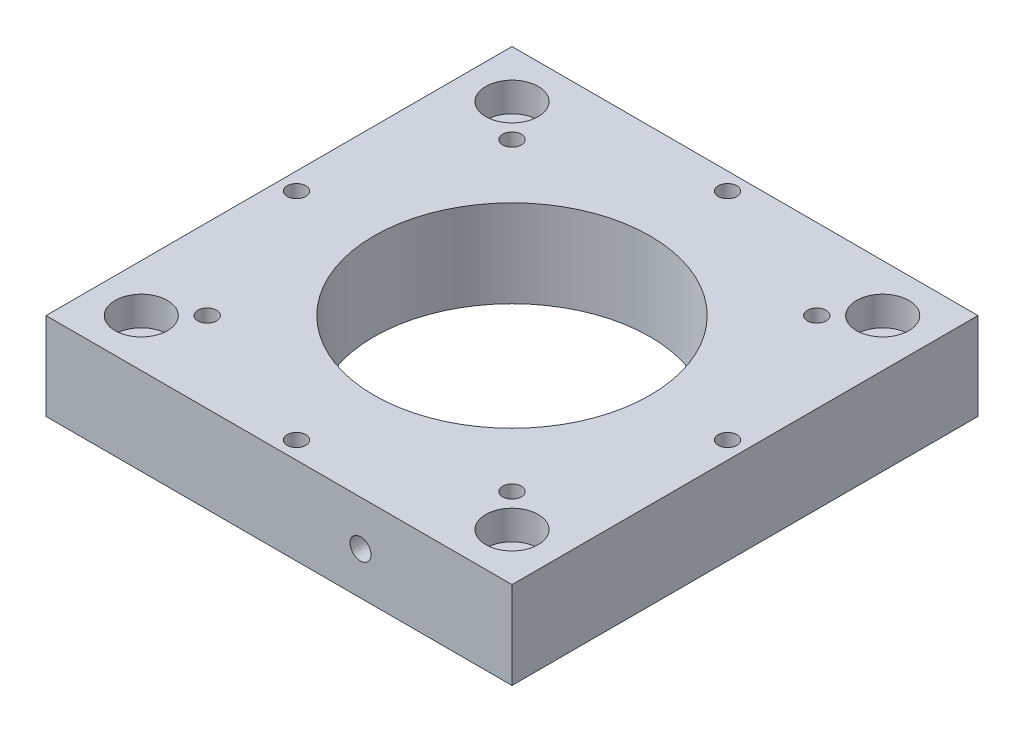
ISO-10303-21;
HEADER;
FILE_DESCRIPTION(('STEP AP214'),'2;1');
FILE_NAME('part.step','',(''),(''),'','','');
FILE_SCHEMA(('AUTOMOTIVE_DESIGN { 1 0 10303 214 1 1 1 1 }'));
ENDSEC;
DATA;
#1=APPLICATION_CONTEXT('core data for automotive mechanical design processes');
#2=APPLICATION_PROTOCOL_DEFINITION('international standard','automotive_design',2000,#1);
#3=PRODUCT_CONTEXT('',#1,'mechanical');
#4=PRODUCT('Part','Part','',(#3));
#5=PRODUCT_RELATED_PRODUCT_CATEGORY('part','',(#4));
#6=PRODUCT_DEFINITION_FORMATION('','',#4);
#7=PRODUCT_DEFINITION_CONTEXT('part definition',#1,'design');
#8=PRODUCT_DEFINITION('design','',#6,#7);
#9=PRODUCT_DEFINITION_SHAPE('','',#8);
#10=(LENGTH_UNIT() NAMED_UNIT(*) SI_UNIT(.MILLI.,.METRE.));
#11=(NAMED_UNIT(*) PLANE_ANGLE_UNIT() SI_UNIT($,.RADIAN.));
#12=(NAMED_UNIT(*) SI_UNIT($,.STERADIAN.) SOLID_ANGLE_UNIT());
#13=UNCERTAINTY_MEASURE_WITH_UNIT(LENGTH_MEASURE(1.E-05),#10,'distance_accuracy_value','');
#14=(GEOMETRIC_REPRESENTATION_CONTEXT(3) GLOBAL_UNCERTAINTY_ASSIGNED_CONTEXT((#13)) GLOBAL_UNIT_ASSIGNED_CONTEXT((#10,
#11,#12)) REPRESENTATION_CONTEXT('',''));
#15=CARTESIAN_POINT('',(0.,0.,0.));
#16=DIRECTION('',(0.,0.,1.));
#17=DIRECTION('',(1.,0.,0.));
#18=AXIS2_PLACEMENT_3D('',#15,#16,#17);
#19=CARTESIAN_POINT('',(-31.8198051533946,15.,-31.8198051533946));
#20=DIRECTION('',(0.,-1.,0.));
#21=DIRECTION('',(0.,0.,-1.));
#22=AXIS2_PLACEMENT_3D('',#19,#20,#21);
#23=CYLINDRICAL_SURFACE('',#22,2.6);
#24=CARTESIAN_POINT('',(-31.8198051533946,0.,-31.8198051533946));
#25=DIRECTION('',(0.,1.,0.));
#26=DIRECTION('',(0.,0.,1.));
#27=AXIS2_PLACEMENT_3D('',#24,#25,#26);
#28=CIRCLE('',#27,2.6);
#29=CARTESIAN_POINT('',(-31.8198051533946,0.,-29.2198051533946));
#30=VERTEX_POINT('',#29);
#31=EDGE_CURVE('E172',#30,#30,#28,.T.);
#32=ORIENTED_EDGE('',*,*,#31,.F.);
#33=EDGE_LOOP('',(#32));
#34=FACE_BOUND('',#33,.T.);
#35=CARTESIAN_POINT('',(-31.8198051533946,10.,-31.8198051533946));
#36=DIRECTION('',(0.,1.,0.));
#37=DIRECTION('',(0.,0.,1.));
#38=AXIS2_PLACEMENT_3D('',#35,#36,#37);
#39=CIRCLE('',#38,2.6);
#40=CARTESIAN_POINT('',(-31.8198051533946,10.,-29.2198051533946));
#41=VERTEX_POINT('',#40);
#42=EDGE_CURVE('E41',#41,#41,#39,.T.);
#43=ORIENTED_EDGE('',*,*,#42,.T.);
#44=EDGE_LOOP('',(#43));
#45=FACE_BOUND('',#44,.T.);
#46=ADVANCED_FACE('F37',(#34,#45),#23,.F.);
#47=CARTESIAN_POINT('',(-31.8198051533892,15.,31.8198051533946));
#48=DIRECTION('',(0.,-1.,0.));
#49=DIRECTION('',(0.,0.,-1.));
#50=AXIS2_PLACEMENT_3D('',#47,#48,#49);
#51=CYLINDRICAL_SURFACE('',#50,2.60000000000144);
#52=CARTESIAN_POINT('',(-31.8198051533892,0.,31.8198051533946));
#53=DIRECTION('',(0.,1.,0.));
#54=DIRECTION('',(0.,0.,1.));
#55=AXIS2_PLACEMENT_3D('',#52,#53,#54);
#56=CIRCLE('',#55,2.60000000000144);
#57=CARTESIAN_POINT('',(-31.8198051533892,0.,34.4198051533961));
#58=VERTEX_POINT('',#57);
#59=EDGE_CURVE('E169',#58,#58,#56,.T.);
#60=ORIENTED_EDGE('',*,*,#59,.F.);
#61=EDGE_LOOP('',(#60));
#62=FACE_BOUND('',#61,.T.);
#63=CARTESIAN_POINT('',(-31.8198051533892,10.,31.8198051533946));
#64=DIRECTION('',(0.,1.,0.));
#65=DIRECTION('',(0.,0.,1.));
#66=AXIS2_PLACEMENT_3D('',#63,#64,#65);
#67=CIRCLE('',#66,2.60000000000144);
#68=CARTESIAN_POINT('',(-31.8198051533892,10.,34.4198051533961));
#69=VERTEX_POINT('',#68);
#70=EDGE_CURVE('E146',#69,#69,#67,.T.);
#71=ORIENTED_EDGE('',*,*,#70,.T.);
#72=EDGE_LOOP('',(#71));
#73=FACE_BOUND('',#72,.T.);
#74=ADVANCED_FACE('F226',(#62,#73),#51,.F.);
#75=CARTESIAN_POINT('',(31.8198051534001,15.,31.8198051533892));
#76=DIRECTION('',(0.,-1.,0.));
#77=DIRECTION('',(0.,0.,-1.));
#78=AXIS2_PLACEMENT_3D('',#75,#76,#77);
#79=CYLINDRICAL_SURFACE('',#78,2.60000000000647);
#80=CARTESIAN_POINT('',(31.8198051534001,0.,31.8198051533892));
#81=DIRECTION('',(0.,1.,0.));
#82=DIRECTION('',(0.,0.,1.));
#83=AXIS2_PLACEMENT_3D('',#80,#81,#82);
#84=CIRCLE('',#83,2.60000000000647);
#85=CARTESIAN_POINT('',(31.8198051534001,0.,34.4198051533957));
#86=VERTEX_POINT('',#85);
#87=EDGE_CURVE('E166',#86,#86,#84,.T.);
#88=ORIENTED_EDGE('',*,*,#87,.F.);
#89=EDGE_LOOP('',(#88));
#90=FACE_BOUND('',#89,.T.);
#91=CARTESIAN_POINT('',(31.8198051534001,10.,31.8198051533892));
#92=DIRECTION('',(0.,1.,0.));
#93=DIRECTION('',(0.,0.,1.));
#94=AXIS2_PLACEMENT_3D('',#91,#92,#93);
#95=CIRCLE('',#94,2.60000000000647);
#96=CARTESIAN_POINT('',(31.8198051534001,10.,34.4198051533957));
#97=VERTEX_POINT('',#96);
#98=EDGE_CURVE('E143',#97,#97,#95,.T.);
#99=ORIENTED_EDGE('',*,*,#98,.T.);
#100=EDGE_LOOP('',(#99));
#101=FACE_BOUND('',#100,.T.);
#102=ADVANCED_FACE('F232',(#90,#101),#79,.F.);
#103=CARTESIAN_POINT('',(31.8198051533947,15.,-31.8198051534001));
#104=DIRECTION('',(0.,-1.,0.));
#105=DIRECTION('',(0.,0.,-1.));
#106=AXIS2_PLACEMENT_3D('',#103,#104,#105);
#107=CYLINDRICAL_SURFACE('',#106,2.60000000000475);
#108=CARTESIAN_POINT('',(31.8198051533947,0.,-31.8198051534001));
#109=DIRECTION('',(0.,1.,0.));
#110=DIRECTION('',(0.,0.,1.));
#111=AXIS2_PLACEMENT_3D('',#108,#109,#110);
#112=CIRCLE('',#111,2.60000000000475);
#113=CARTESIAN_POINT('',(31.8198051533947,0.,-29.2198051533953));
#114=VERTEX_POINT('',#113);
#115=EDGE_CURVE('E139',#114,#114,#112,.T.);
#116=ORIENTED_EDGE('',*,*,#115,.F.);
#117=EDGE_LOOP('',(#116));
#118=FACE_BOUND('',#117,.T.);
#119=CARTESIAN_POINT('',(31.8198051533947,10.,-31.8198051534001));
#120=DIRECTION('',(0.,1.,0.));
#121=DIRECTION('',(0.,0.,1.));
#122=AXIS2_PLACEMENT_3D('',#119,#120,#121);
#123=CIRCLE('',#122,2.60000000000475);
#124=CARTESIAN_POINT('',(31.8198051533947,10.,-29.2198051533953));
#125=VERTEX_POINT('',#124);
#126=EDGE_CURVE('E140',#125,#125,#123,.T.);
#127=ORIENTED_EDGE('',*,*,#126,.T.);
#128=EDGE_LOOP('',(#127));
#129=FACE_BOUND('',#128,.T.);
#130=ADVANCED_FACE('F267',(#118,#129),#107,.F.);
#131=CARTESIAN_POINT('',(0.,15.,-37.));
#132=DIRECTION('',(0.,-1.,0.));
#133=DIRECTION('',(0.,0.,-1.));
#134=AXIS2_PLACEMENT_3D('',#131,#132,#133);
#135=CYLINDRICAL_SURFACE('',#134,1.6);
#136=CARTESIAN_POINT('',(0.,15.,-37.));
#137=DIRECTION('',(0.,1.,0.));
#138=DIRECTION('',(0.,0.,1.));
#139=AXIS2_PLACEMENT_3D('',#136,#137,#138);
#140=CIRCLE('',#139,1.6);
#141=CARTESIAN_POINT('',(0.,15.,-35.4));
#142=VERTEX_POINT('',#141);
#143=EDGE_CURVE('E196',#142,#142,#140,.T.);
#144=ORIENTED_EDGE('',*,*,#143,.T.);
#145=EDGE_LOOP('',(#144));
#146=FACE_BOUND('',#145,.T.);
#147=CARTESIAN_POINT('',(0.,5.,-37.));
#148=DIRECTION('',(0.,-1.,0.));
#149=DIRECTION('',(0.,0.,-1.));
#150=AXIS2_PLACEMENT_3D('',#147,#148,#149);
#151=CIRCLE('',#150,1.6);
#152=CARTESIAN_POINT('',(0.,5.,-38.6));
#153=VERTEX_POINT('',#152);
#154=EDGE_CURVE('E136',#153,#153,#151,.T.);
#155=ORIENTED_EDGE('',*,*,#154,.T.);
#156=EDGE_LOOP('',(#155));
#157=FACE_BOUND('',#156,.T.);
#158=ADVANCED_FACE('F264',(#146,#157),#135,.F.);
#159=CARTESIAN_POINT('',(26.1629509039027,15.,-26.1629509039034));
#160=DIRECTION('',(0.,-1.,0.));
#161=DIRECTION('',(0.,0.,-1.));
#162=AXIS2_PLACEMENT_3D('',#159,#160,#161);
#163=CYLINDRICAL_SURFACE('',#162,1.60000000000018);
#164=CARTESIAN_POINT('',(26.1629509039027,15.,-26.1629509039034));
#165=DIRECTION('',(0.,1.,0.));
#166=DIRECTION('',(0.,0.,1.));
#167=AXIS2_PLACEMENT_3D('',#164,#165,#166);
#168=CIRCLE('',#167,1.60000000000018);
#169=CARTESIAN_POINT('',(26.1629509039027,15.,-24.5629509039032));
#170=VERTEX_POINT('',#169);
#171=EDGE_CURVE('E193',#170,#170,#168,.T.);
#172=ORIENTED_EDGE('',*,*,#171,.T.);
#173=EDGE_LOOP('',(#172));
#174=FACE_BOUND('',#173,.T.);
#175=CARTESIAN_POINT('',(26.1629509039027,5.,-26.1629509039034));
#176=DIRECTION('',(0.,-1.,0.));
#177=DIRECTION('',(0.,0.,-1.));
#178=AXIS2_PLACEMENT_3D('',#175,#176,#177);
#179=CIRCLE('',#178,1.60000000000018);
#180=CARTESIAN_POINT('',(26.1629509039027,5.,-27.7629509039036));
#181=VERTEX_POINT('',#180);
#182=EDGE_CURVE('E133',#181,#181,#179,.T.);
#183=ORIENTED_EDGE('',*,*,#182,.T.);
#184=EDGE_LOOP('',(#183));
#185=FACE_BOUND('',#184,.T.);
#186=ADVANCED_FACE('F261',(#174,#185),#163,.F.);
#187=CARTESIAN_POINT('',(37.0000000000016,15.,-1.57060808365215E-12));
#188=DIRECTION('',(0.,-1.,0.));
#189=DIRECTION('',(0.,0.,-1.));
#190=AXIS2_PLACEMENT_3D('',#187,#188,#189);
#191=CYLINDRICAL_SURFACE('',#190,1.60000000000116);
#192=CARTESIAN_POINT('',(37.0000000000016,15.,-1.57060808365215E-12));
#193=DIRECTION('',(0.,1.,0.));
#194=DIRECTION('',(0.,0.,1.));
#195=AXIS2_PLACEMENT_3D('',#192,#193,#194);
#196=CIRCLE('',#195,1.60000000000116);
#197=CARTESIAN_POINT('',(37.0000000000016,15.,1.59999999999959));
#198=VERTEX_POINT('',#197);
#199=EDGE_CURVE('E190',#198,#198,#196,.T.);
#200=ORIENTED_EDGE('',*,*,#199,.T.);
#201=EDGE_LOOP('',(#200));
#202=FACE_BOUND('',#201,.T.);
#203=CARTESIAN_POINT('',(37.0000000000016,5.,-1.57060808365215E-12));
#204=DIRECTION('',(0.,-1.,0.));
#205=DIRECTION('',(0.,0.,-1.));
#206=AXIS2_PLACEMENT_3D('',#203,#204,#205);
#207=CIRCLE('',#206,1.60000000000116);
#208=CARTESIAN_POINT('',(37.0000000000016,5.,-1.60000000000273));
#209=VERTEX_POINT('',#208);
#210=EDGE_CURVE('E130',#209,#209,#207,.T.);
#211=ORIENTED_EDGE('',*,*,#210,.T.);
#212=EDGE_LOOP('',(#211));
#213=FACE_BOUND('',#212,.T.);
#214=ADVANCED_FACE('F257',(#202,#213),#191,.F.);
#215=CARTESIAN_POINT('',(26.1629509039049,15.,26.1629509039011));
#216=DIRECTION('',(0.,-1.,0.));
#217=DIRECTION('',(0.,0.,-1.));
#218=AXIS2_PLACEMENT_3D('',#215,#216,#217);
#219=CYLINDRICAL_SURFACE('',#218,1.60000000000243);
#220=CARTESIAN_POINT('',(26.1629509039049,15.,26.1629509039011));
#221=DIRECTION('',(0.,1.,0.));
#222=DIRECTION('',(0.,0.,1.));
#223=AXIS2_PLACEMENT_3D('',#220,#221,#222);
#224=CIRCLE('',#223,1.60000000000243);
#225=CARTESIAN_POINT('',(26.1629509039049,15.,27.7629509039036));
#226=VERTEX_POINT('',#225);
#227=EDGE_CURVE('E187',#226,#226,#224,.T.);
#228=ORIENTED_EDGE('',*,*,#227,.T.);
#229=EDGE_LOOP('',(#228));
#230=FACE_BOUND('',#229,.T.);
#231=CARTESIAN_POINT('',(26.1629509039049,5.,26.1629509039011));
#232=DIRECTION('',(0.,-1.,0.));
#233=DIRECTION('',(0.,0.,-1.));
#234=AXIS2_PLACEMENT_3D('',#231,#232,#233);
#235=CIRCLE('',#234,1.60000000000243);
#236=CARTESIAN_POINT('',(26.1629509039049,5.,24.5629509038987));
#237=VERTEX_POINT('',#236);
#238=EDGE_CURVE('E127',#237,#237,#235,.T.);
#239=ORIENTED_EDGE('',*,*,#238,.T.);
#240=EDGE_LOOP('',(#239));
#241=FACE_BOUND('',#240,.T.);
#242=ADVANCED_FACE('F253',(#230,#241),#219,.F.);
#243=CARTESIAN_POINT('',(3.14121616730431E-12,15.,37.));
#244=DIRECTION('',(0.,-1.,0.));
#245=DIRECTION('',(0.,0.,-1.));
#246=AXIS2_PLACEMENT_3D('',#243,#244,#245);
#247=CYLINDRICAL_SURFACE('',#246,1.60000000000325);
#248=CARTESIAN_POINT('',(3.14121616730431E-12,15.,37.));
#249=DIRECTION('',(0.,1.,0.));
#250=DIRECTION('',(0.,0.,1.));
#251=AXIS2_PLACEMENT_3D('',#248,#249,#250);
#252=CIRCLE('',#251,1.60000000000325);
#253=CARTESIAN_POINT('',(3.14121616730431E-12,15.,38.6000000000032));
#254=VERTEX_POINT('',#253);
#255=EDGE_CURVE('E184',#254,#254,#252,.T.);
#256=ORIENTED_EDGE('',*,*,#255,.T.);
#257=EDGE_LOOP('',(#256));
#258=FACE_BOUND('',#257,.T.);
#259=CARTESIAN_POINT('',(3.14121616730431E-12,5.,37.));
#260=DIRECTION('',(0.,-1.,0.));
#261=DIRECTION('',(0.,0.,-1.));
#262=AXIS2_PLACEMENT_3D('',#259,#260,#261);
#263=CIRCLE('',#262,1.60000000000325);
#264=CARTESIAN_POINT('',(3.14121616730431E-12,5.,35.3999999999967));
#265=VERTEX_POINT('',#264);
#266=EDGE_CURVE('E124',#265,#265,#263,.T.);
#267=ORIENTED_EDGE('',*,*,#266,.T.);
#268=EDGE_LOOP('',(#267));
#269=FACE_BOUND('',#268,.T.);
#270=ADVANCED_FACE('F249',(#258,#269),#247,.F.);
#271=CARTESIAN_POINT('',(-26.1629509038996,15.,26.1629509039034));
#272=DIRECTION('',(0.,-1.,0.));
#273=DIRECTION('',(0.,0.,-1.));
#274=AXIS2_PLACEMENT_3D('',#271,#272,#273);
#275=CYLINDRICAL_SURFACE('',#274,1.60000000000319);
#276=CARTESIAN_POINT('',(-26.1629509038996,15.,26.1629509039034));
#277=DIRECTION('',(0.,1.,0.));
#278=DIRECTION('',(0.,0.,1.));
#279=AXIS2_PLACEMENT_3D('',#276,#277,#278);
#280=CIRCLE('',#279,1.60000000000319);
#281=CARTESIAN_POINT('',(-26.1629509038996,15.,27.7629509039066));
#282=VERTEX_POINT('',#281);
#283=EDGE_CURVE('E181',#282,#282,#280,.T.);
#284=ORIENTED_EDGE('',*,*,#283,.T.);
#285=EDGE_LOOP('',(#284));
#286=FACE_BOUND('',#285,.T.);
#287=CARTESIAN_POINT('',(-26.1629509038996,5.,26.1629509039034));
#288=DIRECTION('',(0.,-1.,0.));
#289=DIRECTION('',(0.,0.,-1.));
#290=AXIS2_PLACEMENT_3D('',#287,#288,#289);
#291=CIRCLE('',#290,1.60000000000319);
#292=CARTESIAN_POINT('',(-26.1629509038996,5.,24.5629509039002));
#293=VERTEX_POINT('',#292);
#294=EDGE_CURVE('E121',#293,#293,#291,.T.);
#295=ORIENTED_EDGE('',*,*,#294,.T.);
#296=EDGE_LOOP('',(#295));
#297=FACE_BOUND('',#296,.T.);
#298=ADVANCED_FACE('F245',(#286,#297),#275,.F.);
#299=CARTESIAN_POINT('',(-36.9999999999984,15.,1.575139276809E-12));
#300=DIRECTION('',(0.,-1.,0.));
#301=DIRECTION('',(0.,0.,-1.));
#302=AXIS2_PLACEMENT_3D('',#299,#300,#301);
#303=CYLINDRICAL_SURFACE('',#302,1.60000000000234);
#304=CARTESIAN_POINT('',(-36.9999999999984,15.,1.575139276809E-12));
#305=DIRECTION('',(0.,1.,0.));
#306=DIRECTION('',(0.,0.,1.));
#307=AXIS2_PLACEMENT_3D('',#304,#305,#306);
#308=CIRCLE('',#307,1.60000000000234);
#309=CARTESIAN_POINT('',(-36.9999999999984,15.,1.60000000000391));
#310=VERTEX_POINT('',#309);
#311=EDGE_CURVE('E178',#310,#310,#308,.T.);
#312=ORIENTED_EDGE('',*,*,#311,.T.);
#313=EDGE_LOOP('',(#312));
#314=FACE_BOUND('',#313,.T.);
#315=CARTESIAN_POINT('',(-36.9999999999984,5.,1.575139276809E-12));
#316=DIRECTION('',(0.,-1.,0.));
#317=DIRECTION('',(0.,0.,-1.));
#318=AXIS2_PLACEMENT_3D('',#315,#316,#317);
#319=CIRCLE('',#318,1.60000000000234);
#320=CARTESIAN_POINT('',(-36.9999999999984,5.,-1.60000000000076));
#321=VERTEX_POINT('',#320);
#322=EDGE_CURVE('E117',#321,#321,#319,.T.);
#323=ORIENTED_EDGE('',*,*,#322,.T.);
#324=EDGE_LOOP('',(#323));
#325=FACE_BOUND('',#324,.T.);
#326=ADVANCED_FACE('F241',(#314,#325),#303,.F.);
#327=CARTESIAN_POINT('',(-26.1629509039018,15.,-26.1629509039011));
#328=DIRECTION('',(0.,-1.,0.));
#329=DIRECTION('',(0.,0.,-1.));
#330=AXIS2_PLACEMENT_3D('',#327,#328,#329);
#331=CYLINDRICAL_SURFACE('',#330,1.60000000000121);
#332=CARTESIAN_POINT('',(-26.1629509039018,15.,-26.1629509039011));
#333=DIRECTION('',(0.,1.,0.));
#334=DIRECTION('',(0.,0.,1.));
#335=AXIS2_PLACEMENT_3D('',#332,#333,#334);
#336=CIRCLE('',#335,1.60000000000121);
#337=CARTESIAN_POINT('',(-26.1629509039018,15.,-24.5629509038999));
#338=VERTEX_POINT('',#337);
#339=EDGE_CURVE('E175',#338,#338,#336,.T.);
#340=ORIENTED_EDGE('',*,*,#339,.T.);
#341=EDGE_LOOP('',(#340));
#342=FACE_BOUND('',#341,.T.);
#343=CARTESIAN_POINT('',(-26.1629509039018,5.,-26.1629509039011));
#344=DIRECTION('',(0.,-1.,0.));
#345=DIRECTION('',(0.,0.,-1.));
#346=AXIS2_PLACEMENT_3D('',#343,#344,#345);
#347=CIRCLE('',#346,1.60000000000121);
#348=CARTESIAN_POINT('',(-26.1629509039018,5.,-27.7629509039023));
#349=VERTEX_POINT('',#348);
#350=EDGE_CURVE('E114',#349,#349,#347,.T.);
#351=ORIENTED_EDGE('',*,*,#350,.T.);
#352=EDGE_LOOP('',(#351));
#353=FACE_BOUND('',#352,.T.);
#354=ADVANCED_FACE('F238',(#342,#353),#331,.F.);
#355=CARTESIAN_POINT('',(0.,15.,0.));
#356=DIRECTION('',(0.,1.,0.));
#357=DIRECTION('',(0.,0.,1.));
#358=AXIS2_PLACEMENT_3D('',#355,#356,#357);
#359=PLANE('',#358);
#360=CARTESIAN_POINT('',(-31.8198051533928,15.,31.8198051533946));
#361=DIRECTION('',(0.,1.,0.));
#362=DIRECTION('',(0.,0.,1.));
#363=AXIS2_PLACEMENT_3D('',#360,#361,#362);
#364=CIRCLE('',#363,4.50000000000095);
#365=CARTESIAN_POINT('',(-31.8198051533928,15.,36.3198051533956));
#366=VERTEX_POINT('',#365);
#367=EDGE_CURVE('E335',#366,#366,#364,.T.);
#368=ORIENTED_EDGE('',*,*,#367,.F.);
#369=EDGE_LOOP('',(#368));
#370=FACE_BOUND('',#369,.T.);
#371=CARTESIAN_POINT('',(31.8198051533964,15.,31.8198051533928));
#372=DIRECTION('',(0.,1.,0.));
#373=DIRECTION('',(0.,0.,1.));
#374=AXIS2_PLACEMENT_3D('',#371,#372,#373);
#375=CIRCLE('',#374,4.50000000000253);
#376=CARTESIAN_POINT('',(31.8198051533964,15.,36.3198051533954));
#377=VERTEX_POINT('',#376);
#378=EDGE_CURVE('E339',#377,#377,#375,.T.);
#379=ORIENTED_EDGE('',*,*,#378,.F.);
#380=EDGE_LOOP('',(#379));
#381=FACE_BOUND('',#380,.T.);
#382=CARTESIAN_POINT('',(31.8198051533946,15.,-31.8198051533964));
#383=DIRECTION('',(0.,1.,0.));
#384=DIRECTION('',(0.,0.,1.));
#385=AXIS2_PLACEMENT_3D('',#382,#383,#384);
#386=CIRCLE('',#385,4.50000000000186);
#387=CARTESIAN_POINT('',(31.8198051533946,15.,-27.3198051533946));
#388=VERTEX_POINT('',#387);
#389=EDGE_CURVE('E343',#388,#388,#386,.T.);
#390=ORIENTED_EDGE('',*,*,#389,.F.);
#391=EDGE_LOOP('',(#390));
#392=FACE_BOUND('',#391,.T.);
#393=CARTESIAN_POINT('',(-31.8198051533946,15.,-31.8198051533946));
#394=DIRECTION('',(0.,1.,0.));
#395=DIRECTION('',(0.,0.,1.));
#396=AXIS2_PLACEMENT_3D('',#393,#394,#395);
#397=CIRCLE('',#396,4.5);
#398=CARTESIAN_POINT('',(-31.8198051533946,15.,-27.3198051533946));
#399=VERTEX_POINT('',#398);
#400=EDGE_CURVE('E347',#399,#399,#397,.T.);
#401=ORIENTED_EDGE('',*,*,#400,.F.);
#402=EDGE_LOOP('',(#401));
#403=FACE_BOUND('',#402,.T.);
#404=ORIENTED_EDGE('',*,*,#311,.F.);
#405=EDGE_LOOP('',(#404));
#406=FACE_BOUND('',#405,.T.);
#407=ORIENTED_EDGE('',*,*,#255,.F.);
#408=EDGE_LOOP('',(#407));
#409=FACE_BOUND('',#408,.T.);
#410=ORIENTED_EDGE('',*,*,#199,.F.);
#411=EDGE_LOOP('',(#410));
#412=FACE_BOUND('',#411,.T.);
#413=ORIENTED_EDGE('',*,*,#143,.F.);
#414=EDGE_LOOP('',(#413));
#415=FACE_BOUND('',#414,.T.);
#416=DIRECTION('',(0.,0.,1.));
#417=VECTOR('',#416,1.);
#418=CARTESIAN_POINT('',(-40.,15.,-40.));
#419=LINE('',#418,#417);
#420=CARTESIAN_POINT('',(-40.,15.,-40.));
#421=VERTEX_POINT('',#420);
#422=CARTESIAN_POINT('',(-40.,15.,40.));
#423=VERTEX_POINT('',#422);
#424=EDGE_CURVE('E92',#421,#423,#419,.T.);
#425=ORIENTED_EDGE('',*,*,#424,.T.);
#426=DIRECTION('',(1.,0.,0.));
#427=VECTOR('',#426,1.);
#428=CARTESIAN_POINT('',(-40.,15.,40.));
#429=LINE('',#428,#427);
#430=CARTESIAN_POINT('',(40.,15.,40.));
#431=VERTEX_POINT('',#430);
#432=EDGE_CURVE('E86',#423,#431,#429,.T.);
#433=ORIENTED_EDGE('',*,*,#432,.T.);
#434=DIRECTION('',(0.,0.,-1.));
#435=VECTOR('',#434,1.);
#436=CARTESIAN_POINT('',(40.,15.,-40.));
#437=LINE('',#436,#435);
#438=CARTESIAN_POINT('',(40.,15.,-40.));
#439=VERTEX_POINT('',#438);
#440=EDGE_CURVE('E90',#431,#439,#437,.T.);
#441=ORIENTED_EDGE('',*,*,#440,.T.);
#442=DIRECTION('',(-1.,0.,0.));
#443=VECTOR('',#442,1.);
#444=CARTESIAN_POINT('',(-40.,15.,-40.));
#445=LINE('',#444,#443);
#446=EDGE_CURVE('E56',#439,#421,#445,.T.);
#447=ORIENTED_EDGE('',*,*,#446,.T.);
#448=EDGE_LOOP('',(#425,#433,#441,#447));
#449=FACE_BOUND('',#448,.T.);
#450=CARTESIAN_POINT('',(0.,15.,0.));
#451=DIRECTION('',(0.,1.,0.));
#452=DIRECTION('',(0.,0.,1.));
#453=AXIS2_PLACEMENT_3D('',#450,#451,#452);
#454=CIRCLE('',#453,23.7);
#455=CARTESIAN_POINT('',(0.,15.,23.7));
#456=VERTEX_POINT('',#455);
#457=EDGE_CURVE('E108',#456,#456,#454,.T.);
#458=ORIENTED_EDGE('',*,*,#457,.F.);
#459=EDGE_LOOP('',(#458));
#460=FACE_BOUND('',#459,.T.);
#461=ORIENTED_EDGE('',*,*,#171,.F.);
#462=EDGE_LOOP('',(#461));
#463=FACE_BOUND('',#462,.T.);
#464=ORIENTED_EDGE('',*,*,#227,.F.);
#465=EDGE_LOOP('',(#464));
#466=FACE_BOUND('',#465,.T.);
#467=ORIENTED_EDGE('',*,*,#283,.F.);
#468=EDGE_LOOP('',(#467));
#469=FACE_BOUND('',#468,.T.);
#470=ORIENTED_EDGE('',*,*,#339,.F.);
#471=EDGE_LOOP('',(#470));
#472=FACE_BOUND('',#471,.T.);
#473=ADVANCED_FACE('F87',(#370,#381,#392,#403,#406,#409,#412,#415,#449,#460,#463,#466,#469,
#472),#359,.T.);
#474=CARTESIAN_POINT('',(0.,0.,0.));
#475=DIRECTION('',(0.,1.,0.));
#476=DIRECTION('',(0.,0.,1.));
#477=AXIS2_PLACEMENT_3D('',#474,#475,#476);
#478=PLANE('',#477);
#479=CARTESIAN_POINT('',(3.14121616730431E-12,0.,37.));
#480=DIRECTION('',(0.,-1.,0.));
#481=DIRECTION('',(0.,0.,-1.));
#482=AXIS2_PLACEMENT_3D('',#479,#480,#481);
#483=CIRCLE('',#482,2.9);
#484=CARTESIAN_POINT('',(3.14121616730431E-12,0.,34.1));
#485=VERTEX_POINT('',#484);
#486=EDGE_CURVE('E452',#485,#485,#483,.T.);
#487=ORIENTED_EDGE('',*,*,#486,.F.);
#488=EDGE_LOOP('',(#487));
#489=FACE_BOUND('',#488,.T.);
#490=CARTESIAN_POINT('',(26.1629509039049,0.,26.1629509039011));
#491=DIRECTION('',(0.,-1.,0.));
#492=DIRECTION('',(0.,0.,-1.));
#493=AXIS2_PLACEMENT_3D('',#490,#491,#492);
#494=CIRCLE('',#493,2.90000000000018);
#495=CARTESIAN_POINT('',(26.1629509039049,0.,23.262950903901));
#496=VERTEX_POINT('',#495);
#497=EDGE_CURVE('E367',#496,#496,#494,.T.);
#498=ORIENTED_EDGE('',*,*,#497,.F.);
#499=EDGE_LOOP('',(#498));
#500=FACE_BOUND('',#499,.T.);
#501=CARTESIAN_POINT('',(37.0000000000015,0.,-1.58420166312269E-12));
#502=DIRECTION('',(0.,-1.,0.));
#503=DIRECTION('',(0.,0.,-1.));
#504=AXIS2_PLACEMENT_3D('',#501,#502,#503);
#505=CIRCLE('',#504,2.90000000000115);
#506=CARTESIAN_POINT('',(37.0000000000015,0.,-2.90000000000274));
#507=VERTEX_POINT('',#506);
#508=EDGE_CURVE('E368',#507,#507,#505,.T.);
#509=ORIENTED_EDGE('',*,*,#508,.F.);
#510=EDGE_LOOP('',(#509));
#511=FACE_BOUND('',#510,.T.);
#512=CARTESIAN_POINT('',(26.1629509039027,0.,-26.1629509039034));
#513=DIRECTION('',(0.,-1.,0.));
#514=DIRECTION('',(0.,0.,-1.));
#515=AXIS2_PLACEMENT_3D('',#512,#513,#514);
#516=CIRCLE('',#515,2.90000000000241);
#517=CARTESIAN_POINT('',(26.1629509039027,0.,-29.0629509039058));
#518=VERTEX_POINT('',#517);
#519=EDGE_CURVE('E288',#518,#518,#516,.T.);
#520=ORIENTED_EDGE('',*,*,#519,.F.);
#521=EDGE_LOOP('',(#520));
#522=FACE_BOUND('',#521,.T.);
#523=CARTESIAN_POINT('',(0.,0.,-37.));
#524=DIRECTION('',(0.,-1.,0.));
#525=DIRECTION('',(0.,0.,-1.));
#526=AXIS2_PLACEMENT_3D('',#523,#524,#525);
#527=CIRCLE('',#526,2.90000000000322);
#528=CARTESIAN_POINT('',(0.,0.,-39.9000000000032));
#529=VERTEX_POINT('',#528);
#530=EDGE_CURVE('E289',#529,#529,#527,.T.);
#531=ORIENTED_EDGE('',*,*,#530,.F.);
#532=EDGE_LOOP('',(#531));
#533=FACE_BOUND('',#532,.T.);
#534=CARTESIAN_POINT('',(-26.1629509039018,0.,-26.1629509039011));
#535=DIRECTION('',(0.,-1.,0.));
#536=DIRECTION('',(0.,0.,-1.));
#537=AXIS2_PLACEMENT_3D('',#534,#535,#536);
#538=CIRCLE('',#537,2.90000000000316);
#539=CARTESIAN_POINT('',(-26.1629509039018,0.,-29.0629509039043));
#540=VERTEX_POINT('',#539);
#541=EDGE_CURVE('E301',#540,#540,#538,.T.);
#542=ORIENTED_EDGE('',*,*,#541,.F.);
#543=EDGE_LOOP('',(#542));
#544=FACE_BOUND('',#543,.T.);
#545=CARTESIAN_POINT('',(-36.9999999999984,0.,1.57967046996585E-12));
#546=DIRECTION('',(0.,-1.,0.));
#547=DIRECTION('',(0.,0.,-1.));
#548=AXIS2_PLACEMENT_3D('',#545,#546,#547);
#549=CIRCLE('',#548,2.90000000000232);
#550=CARTESIAN_POINT('',(-36.9999999999984,0.,-2.90000000000074));
#551=VERTEX_POINT('',#550);
#552=EDGE_CURVE('E160',#551,#551,#549,.T.);
#553=ORIENTED_EDGE('',*,*,#552,.F.);
#554=EDGE_LOOP('',(#553));
#555=FACE_BOUND('',#554,.T.);
#556=CARTESIAN_POINT('',(-26.1629509038996,0.,26.1629509039034));
#557=DIRECTION('',(0.,-1.,0.));
#558=DIRECTION('',(0.,0.,-1.));
#559=AXIS2_PLACEMENT_3D('',#556,#557,#558);
#560=CIRCLE('',#559,2.9000000000012);
#561=CARTESIAN_POINT('',(-26.1629509038996,0.,23.2629509039022));
#562=VERTEX_POINT('',#561);
#563=EDGE_CURVE('E151',#562,#562,#560,.T.);
#564=ORIENTED_EDGE('',*,*,#563,.F.);
#565=EDGE_LOOP('',(#564));
#566=FACE_BOUND('',#565,.T.);
#567=DIRECTION('',(0.,0.,1.));
#568=VECTOR('',#567,1.);
#569=CARTESIAN_POINT('',(-40.,0.,-40.));
#570=LINE('',#569,#568);
#571=CARTESIAN_POINT('',(-40.,0.,-40.));
#572=VERTEX_POINT('',#571);
#573=CARTESIAN_POINT('',(-40.,0.,40.));
#574=VERTEX_POINT('',#573);
#575=EDGE_CURVE('E105',#572,#574,#570,.T.);
#576=ORIENTED_EDGE('',*,*,#575,.F.);
#577=DIRECTION('',(-1.,0.,0.));
#578=VECTOR('',#577,1.);
#579=CARTESIAN_POINT('',(-40.,0.,-40.));
#580=LINE('',#579,#578);
#581=CARTESIAN_POINT('',(40.,0.,-40.));
#582=VERTEX_POINT('',#581);
#583=EDGE_CURVE('E79',#582,#572,#580,.T.);
#584=ORIENTED_EDGE('',*,*,#583,.F.);
#585=DIRECTION('',(0.,0.,-1.));
#586=VECTOR('',#585,1.);
#587=CARTESIAN_POINT('',(40.,0.,-40.));
#588=LINE('',#587,#586);
#589=CARTESIAN_POINT('',(40.,0.,40.));
#590=VERTEX_POINT('',#589);
#591=EDGE_CURVE('E73',#590,#582,#588,.T.);
#592=ORIENTED_EDGE('',*,*,#591,.F.);
#593=DIRECTION('',(1.,0.,0.));
#594=VECTOR('',#593,1.);
#595=CARTESIAN_POINT('',(-40.,0.,40.));
#596=LINE('',#595,#594);
#597=EDGE_CURVE('E96',#574,#590,#596,.T.);
#598=ORIENTED_EDGE('',*,*,#597,.F.);
#599=EDGE_LOOP('',(#576,#584,#592,#598));
#600=FACE_BOUND('',#599,.T.);
#601=CARTESIAN_POINT('',(0.,0.,0.));
#602=DIRECTION('',(0.,1.,0.));
#603=DIRECTION('',(0.,0.,1.));
#604=AXIS2_PLACEMENT_3D('',#601,#602,#603);
#605=CIRCLE('',#604,23.7);
#606=CARTESIAN_POINT('',(0.,0.,23.7));
#607=VERTEX_POINT('',#606);
#608=EDGE_CURVE('E199',#607,#607,#605,.T.);
#609=ORIENTED_EDGE('',*,*,#608,.T.);
#610=EDGE_LOOP('',(#609));
#611=FACE_BOUND('',#610,.T.);
#612=ORIENTED_EDGE('',*,*,#31,.T.);
#613=EDGE_LOOP('',(#612));
#614=FACE_BOUND('',#613,.T.);
#615=ORIENTED_EDGE('',*,*,#59,.T.);
#616=EDGE_LOOP('',(#615));
#617=FACE_BOUND('',#616,.T.);
#618=ORIENTED_EDGE('',*,*,#87,.T.);
#619=EDGE_LOOP('',(#618));
#620=FACE_BOUND('',#619,.T.);
#621=ORIENTED_EDGE('',*,*,#115,.T.);
#622=EDGE_LOOP('',(#621));
#623=FACE_BOUND('',#622,.T.);
#624=ADVANCED_FACE('F205',(#489,#500,#511,#522,#533,#544,#555,#566,#600,#611,#614,#617,#620,
#623),#478,.F.);
#625=CARTESIAN_POINT('',(-40.,15.,-40.));
#626=DIRECTION('',(1.,0.,0.));
#627=DIRECTION('',(0.,0.,-1.));
#628=AXIS2_PLACEMENT_3D('',#625,#626,#627);
#629=PLANE('',#628);
#630=ORIENTED_EDGE('',*,*,#575,.T.);
#631=DIRECTION('',(0.,-1.,0.));
#632=VECTOR('',#631,1.);
#633=CARTESIAN_POINT('',(-40.,15.,40.));
#634=LINE('',#633,#632);
#635=EDGE_CURVE('E11',#423,#574,#634,.T.);
#636=ORIENTED_EDGE('',*,*,#635,.F.);
#637=ORIENTED_EDGE('',*,*,#424,.F.);
#638=DIRECTION('',(0.,-1.,0.));
#639=VECTOR('',#638,1.);
#640=CARTESIAN_POINT('',(-40.,15.,-40.));
#641=LINE('',#640,#639);
#642=EDGE_CURVE('E101',#421,#572,#641,.T.);
#643=ORIENTED_EDGE('',*,*,#642,.T.);
#644=EDGE_LOOP('',(#630,#636,#637,#643));
#645=FACE_BOUND('',#644,.T.);
#646=ADVANCED_FACE('F39',(#645),#629,.F.);
#647=CARTESIAN_POINT('',(-40.,15.,40.));
#648=DIRECTION('',(0.,0.,-1.));
#649=DIRECTION('',(-1.,0.,0.));
#650=AXIS2_PLACEMENT_3D('',#647,#648,#649);
#651=PLANE('',#650);
#652=CARTESIAN_POINT('',(13.9983079627903,7.31055357541521,40.));
#653=DIRECTION('',(0.,0.,1.));
#654=DIRECTION('',(1.,0.,0.));
#655=AXIS2_PLACEMENT_3D('',#652,#653,#654);
#656=CIRCLE('',#655,1.8);
#657=CARTESIAN_POINT('',(15.7983079627903,7.31055357541521,40.));
#658=VERTEX_POINT('',#657);
#659=EDGE_CURVE('E527',#658,#658,#656,.T.);
#660=ORIENTED_EDGE('',*,*,#659,.F.);
#661=EDGE_LOOP('',(#660));
#662=FACE_BOUND('',#661,.T.);
#663=ORIENTED_EDGE('',*,*,#597,.T.);
#664=DIRECTION('',(0.,-1.,0.));
#665=VECTOR('',#664,1.);
#666=CARTESIAN_POINT('',(40.,15.,40.));
#667=LINE('',#666,#665);
#668=EDGE_CURVE('E47',#431,#590,#667,.T.);
#669=ORIENTED_EDGE('',*,*,#668,.F.);
#670=ORIENTED_EDGE('',*,*,#432,.F.);
#671=ORIENTED_EDGE('',*,*,#635,.T.);
#672=EDGE_LOOP('',(#663,#669,#670,#671));
#673=FACE_BOUND('',#672,.T.);
#674=ADVANCED_FACE('F95',(#662,#673),#651,.F.);
#675=CARTESIAN_POINT('',(40.,15.,-40.));
#676=DIRECTION('',(-1.,0.,0.));
#677=DIRECTION('',(0.,0.,1.));
#678=AXIS2_PLACEMENT_3D('',#675,#676,#677);
#679=PLANE('',#678);
#680=ORIENTED_EDGE('',*,*,#591,.T.);
#681=DIRECTION('',(0.,-1.,0.));
#682=VECTOR('',#681,1.);
#683=CARTESIAN_POINT('',(40.,15.,-40.));
#684=LINE('',#683,#682);
#685=EDGE_CURVE('E97',#439,#582,#684,.T.);
#686=ORIENTED_EDGE('',*,*,#685,.F.);
#687=ORIENTED_EDGE('',*,*,#440,.F.);
#688=ORIENTED_EDGE('',*,*,#668,.T.);
#689=EDGE_LOOP('',(#680,#686,#687,#688));
#690=FACE_BOUND('',#689,.T.);
#691=ADVANCED_FACE('F99',(#690),#679,.F.);
#692=CARTESIAN_POINT('',(-40.,15.,-40.));
#693=DIRECTION('',(0.,0.,1.));
#694=DIRECTION('',(1.,0.,0.));
#695=AXIS2_PLACEMENT_3D('',#692,#693,#694);
#696=PLANE('',#695);
#697=CARTESIAN_POINT('',(16.5047695518547,7.35115731698373,-40.));
#698=DIRECTION('',(0.,0.,-1.));
#699=DIRECTION('',(-1.,0.,0.));
#700=AXIS2_PLACEMENT_3D('',#697,#698,#699);
#701=CIRCLE('',#700,1.8);
#702=CARTESIAN_POINT('',(14.7047695518547,7.35115731698373,-40.));
#703=VERTEX_POINT('',#702);
#704=EDGE_CURVE('E528',#703,#703,#701,.T.);
#705=ORIENTED_EDGE('',*,*,#704,.F.);
#706=EDGE_LOOP('',(#705));
#707=FACE_BOUND('',#706,.T.);
#708=ORIENTED_EDGE('',*,*,#583,.T.);
#709=ORIENTED_EDGE('',*,*,#642,.F.);
#710=ORIENTED_EDGE('',*,*,#446,.F.);
#711=ORIENTED_EDGE('',*,*,#685,.T.);
#712=EDGE_LOOP('',(#708,#709,#710,#711));
#713=FACE_BOUND('',#712,.T.);
#714=ADVANCED_FACE('F211',(#707,#713),#696,.F.);
#715=CARTESIAN_POINT('',(0.,15.,0.));
#716=DIRECTION('',(0.,-1.,0.));
#717=DIRECTION('',(0.,0.,-1.));
#718=AXIS2_PLACEMENT_3D('',#715,#716,#717);
#719=CYLINDRICAL_SURFACE('',#718,23.7);
#720=ORIENTED_EDGE('',*,*,#457,.T.);
#721=EDGE_LOOP('',(#720));
#722=FACE_BOUND('',#721,.T.);
#723=ORIENTED_EDGE('',*,*,#608,.F.);
#724=EDGE_LOOP('',(#723));
#725=FACE_BOUND('',#724,.T.);
#726=ADVANCED_FACE('F208',(#722,#725),#719,.F.);
#727=CARTESIAN_POINT('',(-26.1629509039018,5.,-26.1629509039011));
#728=DIRECTION('',(0.,-1.,0.));
#729=DIRECTION('',(0.,0.,-1.));
#730=AXIS2_PLACEMENT_3D('',#727,#728,#729);
#731=CYLINDRICAL_SURFACE('',#730,2.90000000000316);
#732=CARTESIAN_POINT('',(-26.1629509039018,5.,-26.1629509039011));
#733=DIRECTION('',(0.,-1.,0.));
#734=DIRECTION('',(0.,0.,-1.));
#735=AXIS2_PLACEMENT_3D('',#732,#733,#734);
#736=CIRCLE('',#735,2.90000000000316);
#737=CARTESIAN_POINT('',(-26.1629509039018,5.,-29.0629509039043));
#738=VERTEX_POINT('',#737);
#739=EDGE_CURVE('E295',#738,#738,#736,.T.);
#740=ORIENTED_EDGE('',*,*,#739,.F.);
#741=EDGE_LOOP('',(#740));
#742=FACE_BOUND('',#741,.T.);
#743=ORIENTED_EDGE('',*,*,#541,.T.);
#744=EDGE_LOOP('',(#743));
#745=FACE_BOUND('',#744,.T.);
#746=ADVANCED_FACE('F210',(#742,#745),#731,.F.);
#747=CARTESIAN_POINT('',(-26.1629509039018,5.,-26.1629509039011));
#748=DIRECTION('',(0.,-1.,0.));
#749=DIRECTION('',(0.,0.,-1.));
#750=AXIS2_PLACEMENT_3D('',#747,#748,#749);
#751=PLANE('',#750);
#752=ORIENTED_EDGE('',*,*,#350,.F.);
#753=EDGE_LOOP('',(#752));
#754=FACE_BOUND('',#753,.T.);
#755=ORIENTED_EDGE('',*,*,#739,.T.);
#756=EDGE_LOOP('',(#755));
#757=FACE_BOUND('',#756,.T.);
#758=ADVANCED_FACE('F218',(#754,#757),#751,.T.);
#759=CARTESIAN_POINT('',(-36.9999999999984,5.,1.57967046996585E-12));
#760=DIRECTION('',(0.,-1.,0.));
#761=DIRECTION('',(0.,0.,-1.));
#762=AXIS2_PLACEMENT_3D('',#759,#760,#761);
#763=CYLINDRICAL_SURFACE('',#762,2.90000000000232);
#764=CARTESIAN_POINT('',(-36.9999999999984,5.,1.57967046996585E-12));
#765=DIRECTION('',(0.,-1.,0.));
#766=DIRECTION('',(0.,0.,-1.));
#767=AXIS2_PLACEMENT_3D('',#764,#765,#766);
#768=CIRCLE('',#767,2.90000000000232);
#769=CARTESIAN_POINT('',(-36.9999999999984,5.,-2.90000000000074));
#770=VERTEX_POINT('',#769);
#771=EDGE_CURVE('E304',#770,#770,#768,.T.);
#772=ORIENTED_EDGE('',*,*,#771,.F.);
#773=EDGE_LOOP('',(#772));
#774=FACE_BOUND('',#773,.T.);
#775=ORIENTED_EDGE('',*,*,#552,.T.);
#776=EDGE_LOOP('',(#775));
#777=FACE_BOUND('',#776,.T.);
#778=ADVANCED_FACE('F309',(#774,#777),#763,.F.);
#779=CARTESIAN_POINT('',(-36.9999999999984,5.,1.57967046996585E-12));
#780=DIRECTION('',(0.,-1.,0.));
#781=DIRECTION('',(0.,0.,-1.));
#782=AXIS2_PLACEMENT_3D('',#779,#780,#781);
#783=PLANE('',#782);
#784=ORIENTED_EDGE('',*,*,#322,.F.);
#785=EDGE_LOOP('',(#784));
#786=FACE_BOUND('',#785,.T.);
#787=ORIENTED_EDGE('',*,*,#771,.T.);
#788=EDGE_LOOP('',(#787));
#789=FACE_BOUND('',#788,.T.);
#790=ADVANCED_FACE('F403',(#786,#789),#783,.T.);
#791=CARTESIAN_POINT('',(-26.1629509038996,5.,26.1629509039034));
#792=DIRECTION('',(0.,-1.,0.));
#793=DIRECTION('',(0.,0.,-1.));
#794=AXIS2_PLACEMENT_3D('',#791,#792,#793);
#795=CYLINDRICAL_SURFACE('',#794,2.9000000000012);
#796=CARTESIAN_POINT('',(-26.1629509038996,5.,26.1629509039034));
#797=DIRECTION('',(0.,-1.,0.));
#798=DIRECTION('',(0.,0.,-1.));
#799=AXIS2_PLACEMENT_3D('',#796,#797,#798);
#800=CIRCLE('',#799,2.9000000000012);
#801=CARTESIAN_POINT('',(-26.1629509038996,5.,23.2629509039022));
#802=VERTEX_POINT('',#801);
#803=EDGE_CURVE('E155',#802,#802,#800,.T.);
#804=ORIENTED_EDGE('',*,*,#803,.F.);
#805=EDGE_LOOP('',(#804));
#806=FACE_BOUND('',#805,.T.);
#807=ORIENTED_EDGE('',*,*,#563,.T.);
#808=EDGE_LOOP('',(#807));
#809=FACE_BOUND('',#808,.T.);
#810=ADVANCED_FACE('F406',(#806,#809),#795,.F.);
#811=CARTESIAN_POINT('',(-26.1629509038996,5.,26.1629509039034));
#812=DIRECTION('',(0.,-1.,0.));
#813=DIRECTION('',(0.,0.,-1.));
#814=AXIS2_PLACEMENT_3D('',#811,#812,#813);
#815=PLANE('',#814);
#816=ORIENTED_EDGE('',*,*,#294,.F.);
#817=EDGE_LOOP('',(#816));
#818=FACE_BOUND('',#817,.T.);
#819=ORIENTED_EDGE('',*,*,#803,.T.);
#820=EDGE_LOOP('',(#819));
#821=FACE_BOUND('',#820,.T.);
#822=ADVANCED_FACE('F411',(#818,#821),#815,.T.);
#823=CARTESIAN_POINT('',(3.14121616730431E-12,5.,37.));
#824=DIRECTION('',(0.,-1.,0.));
#825=DIRECTION('',(0.,0.,-1.));
#826=AXIS2_PLACEMENT_3D('',#823,#824,#825);
#827=CYLINDRICAL_SURFACE('',#826,2.9);
#828=CARTESIAN_POINT('',(3.14121616730431E-12,5.,37.));
#829=DIRECTION('',(0.,-1.,0.));
#830=DIRECTION('',(0.,0.,-1.));
#831=AXIS2_PLACEMENT_3D('',#828,#829,#830);
#832=CIRCLE('',#831,2.9);
#833=CARTESIAN_POINT('',(3.14121616730431E-12,5.,34.1));
#834=VERTEX_POINT('',#833);
#835=EDGE_CURVE('E118',#834,#834,#832,.T.);
#836=ORIENTED_EDGE('',*,*,#835,.F.);
#837=EDGE_LOOP('',(#836));
#838=FACE_BOUND('',#837,.T.);
#839=ORIENTED_EDGE('',*,*,#486,.T.);
#840=EDGE_LOOP('',(#839));
#841=FACE_BOUND('',#840,.T.);
#842=ADVANCED_FACE('F414',(#838,#841),#827,.F.);
#843=CARTESIAN_POINT('',(3.14121616730431E-12,5.,37.));
#844=DIRECTION('',(0.,-1.,0.));
#845=DIRECTION('',(0.,0.,-1.));
#846=AXIS2_PLACEMENT_3D('',#843,#844,#845);
#847=PLANE('',#846);
#848=ORIENTED_EDGE('',*,*,#266,.F.);
#849=EDGE_LOOP('',(#848));
#850=FACE_BOUND('',#849,.T.);
#851=ORIENTED_EDGE('',*,*,#835,.T.);
#852=EDGE_LOOP('',(#851));
#853=FACE_BOUND('',#852,.T.);
#854=ADVANCED_FACE('F462',(#850,#853),#847,.T.);
#855=CARTESIAN_POINT('',(26.1629509039049,5.,26.1629509039011));
#856=DIRECTION('',(0.,-1.,0.));
#857=DIRECTION('',(0.,0.,-1.));
#858=AXIS2_PLACEMENT_3D('',#855,#856,#857);
#859=CYLINDRICAL_SURFACE('',#858,2.90000000000018);
#860=CARTESIAN_POINT('',(26.1629509039049,5.,26.1629509039011));
#861=DIRECTION('',(0.,-1.,0.));
#862=DIRECTION('',(0.,0.,-1.));
#863=AXIS2_PLACEMENT_3D('',#860,#861,#862);
#864=CIRCLE('',#863,2.90000000000018);
#865=CARTESIAN_POINT('',(26.1629509039049,5.,23.262950903901));
#866=VERTEX_POINT('',#865);
#867=EDGE_CURVE('E371',#866,#866,#864,.T.);
#868=ORIENTED_EDGE('',*,*,#867,.F.);
#869=EDGE_LOOP('',(#868));
#870=FACE_BOUND('',#869,.T.);
#871=ORIENTED_EDGE('',*,*,#497,.T.);
#872=EDGE_LOOP('',(#871));
#873=FACE_BOUND('',#872,.T.);
#874=ADVANCED_FACE('F459',(#870,#873),#859,.F.);
#875=CARTESIAN_POINT('',(26.1629509039049,5.,26.1629509039011));
#876=DIRECTION('',(0.,-1.,0.));
#877=DIRECTION('',(0.,0.,-1.));
#878=AXIS2_PLACEMENT_3D('',#875,#876,#877);
#879=PLANE('',#878);
#880=ORIENTED_EDGE('',*,*,#238,.F.);
#881=EDGE_LOOP('',(#880));
#882=FACE_BOUND('',#881,.T.);
#883=ORIENTED_EDGE('',*,*,#867,.T.);
#884=EDGE_LOOP('',(#883));
#885=FACE_BOUND('',#884,.T.);
#886=ADVANCED_FACE('F457',(#882,#885),#879,.T.);
#887=CARTESIAN_POINT('',(37.0000000000015,5.,-1.58420166312269E-12));
#888=DIRECTION('',(0.,-1.,0.));
#889=DIRECTION('',(0.,0.,-1.));
#890=AXIS2_PLACEMENT_3D('',#887,#888,#889);
#891=CYLINDRICAL_SURFACE('',#890,2.90000000000115);
#892=CARTESIAN_POINT('',(37.0000000000015,5.,-1.58420166312269E-12));
#893=DIRECTION('',(0.,-1.,0.));
#894=DIRECTION('',(0.,0.,-1.));
#895=AXIS2_PLACEMENT_3D('',#892,#893,#894);
#896=CIRCLE('',#895,2.90000000000115);
#897=CARTESIAN_POINT('',(37.0000000000015,5.,-2.90000000000274));
#898=VERTEX_POINT('',#897);
#899=EDGE_CURVE('E365',#898,#898,#896,.T.);
#900=ORIENTED_EDGE('',*,*,#899,.F.);
#901=EDGE_LOOP('',(#900));
#902=FACE_BOUND('',#901,.T.);
#903=ORIENTED_EDGE('',*,*,#508,.T.);
#904=EDGE_LOOP('',(#903));
#905=FACE_BOUND('',#904,.T.);
#906=ADVANCED_FACE('F361',(#902,#905),#891,.F.);
#907=CARTESIAN_POINT('',(37.0000000000015,5.,-1.58420166312269E-12));
#908=DIRECTION('',(0.,-1.,0.));
#909=DIRECTION('',(0.,0.,-1.));
#910=AXIS2_PLACEMENT_3D('',#907,#908,#909);
#911=PLANE('',#910);
#912=ORIENTED_EDGE('',*,*,#210,.F.);
#913=EDGE_LOOP('',(#912));
#914=FACE_BOUND('',#913,.T.);
#915=ORIENTED_EDGE('',*,*,#899,.T.);
#916=EDGE_LOOP('',(#915));
#917=FACE_BOUND('',#916,.T.);
#918=ADVANCED_FACE('F357',(#914,#917),#911,.T.);
#919=CARTESIAN_POINT('',(26.1629509039027,5.,-26.1629509039034));
#920=DIRECTION('',(0.,-1.,0.));
#921=DIRECTION('',(0.,0.,-1.));
#922=AXIS2_PLACEMENT_3D('',#919,#920,#921);
#923=CYLINDRICAL_SURFACE('',#922,2.90000000000241);
#924=CARTESIAN_POINT('',(26.1629509039027,5.,-26.1629509039034));
#925=DIRECTION('',(0.,-1.,0.));
#926=DIRECTION('',(0.,0.,-1.));
#927=AXIS2_PLACEMENT_3D('',#924,#925,#926);
#928=CIRCLE('',#927,2.90000000000241);
#929=CARTESIAN_POINT('',(26.1629509039027,5.,-29.0629509039058));
#930=VERTEX_POINT('',#929);
#931=EDGE_CURVE('E292',#930,#930,#928,.T.);
#932=ORIENTED_EDGE('',*,*,#931,.F.);
#933=EDGE_LOOP('',(#932));
#934=FACE_BOUND('',#933,.T.);
#935=ORIENTED_EDGE('',*,*,#519,.T.);
#936=EDGE_LOOP('',(#935));
#937=FACE_BOUND('',#936,.T.);
#938=ADVANCED_FACE('F360',(#934,#937),#923,.F.);
#939=CARTESIAN_POINT('',(26.1629509039027,5.,-26.1629509039034));
#940=DIRECTION('',(0.,-1.,0.));
#941=DIRECTION('',(0.,0.,-1.));
#942=AXIS2_PLACEMENT_3D('',#939,#940,#941);
#943=PLANE('',#942);
#944=ORIENTED_EDGE('',*,*,#182,.F.);
#945=EDGE_LOOP('',(#944));
#946=FACE_BOUND('',#945,.T.);
#947=ORIENTED_EDGE('',*,*,#931,.T.);
#948=EDGE_LOOP('',(#947));
#949=FACE_BOUND('',#948,.T.);
#950=ADVANCED_FACE('F379',(#946,#949),#943,.T.);
#951=CARTESIAN_POINT('',(0.,5.,-37.));
#952=DIRECTION('',(0.,-1.,0.));
#953=DIRECTION('',(0.,0.,-1.));
#954=AXIS2_PLACEMENT_3D('',#951,#952,#953);
#955=CYLINDRICAL_SURFACE('',#954,2.90000000000322);
#956=CARTESIAN_POINT('',(0.,5.,-37.));
#957=DIRECTION('',(0.,-1.,0.));
#958=DIRECTION('',(0.,0.,-1.));
#959=AXIS2_PLACEMENT_3D('',#956,#957,#958);
#960=CIRCLE('',#959,2.90000000000322);
#961=CARTESIAN_POINT('',(0.,5.,-39.9000000000032));
#962=VERTEX_POINT('',#961);
#963=EDGE_CURVE('E286',#962,#962,#960,.T.);
#964=ORIENTED_EDGE('',*,*,#963,.F.);
#965=EDGE_LOOP('',(#964));
#966=FACE_BOUND('',#965,.T.);
#967=ORIENTED_EDGE('',*,*,#530,.T.);
#968=EDGE_LOOP('',(#967));
#969=FACE_BOUND('',#968,.T.);
#970=ADVANCED_FACE('F282',(#966,#969),#955,.F.);
#971=CARTESIAN_POINT('',(0.,5.,-37.));
#972=DIRECTION('',(0.,-1.,0.));
#973=DIRECTION('',(0.,0.,-1.));
#974=AXIS2_PLACEMENT_3D('',#971,#972,#973);
#975=PLANE('',#974);
#976=ORIENTED_EDGE('',*,*,#154,.F.);
#977=EDGE_LOOP('',(#976));
#978=FACE_BOUND('',#977,.T.);
#979=ORIENTED_EDGE('',*,*,#963,.T.);
#980=EDGE_LOOP('',(#979));
#981=FACE_BOUND('',#980,.T.);
#982=ADVANCED_FACE('F278',(#978,#981),#975,.T.);
#983=CARTESIAN_POINT('',(31.8198051533946,10.,-31.8198051533964));
#984=DIRECTION('',(0.,1.,0.));
#985=DIRECTION('',(0.,0.,1.));
#986=AXIS2_PLACEMENT_3D('',#983,#984,#985);
#987=CYLINDRICAL_SURFACE('',#986,4.50000000000186);
#988=CARTESIAN_POINT('',(31.8198051533946,10.,-31.8198051533964));
#989=DIRECTION('',(0.,1.,0.));
#990=DIRECTION('',(0.,0.,1.));
#991=AXIS2_PLACEMENT_3D('',#988,#989,#990);
#992=CIRCLE('',#991,4.50000000000186);
#993=CARTESIAN_POINT('',(31.8198051533946,10.,-27.3198051533946));
#994=VERTEX_POINT('',#993);
#995=EDGE_CURVE('E437',#994,#994,#992,.T.);
#996=ORIENTED_EDGE('',*,*,#995,.F.);
#997=EDGE_LOOP('',(#996));
#998=FACE_BOUND('',#997,.T.);
#999=ORIENTED_EDGE('',*,*,#389,.T.);
#1000=EDGE_LOOP('',(#999));
#1001=FACE_BOUND('',#1000,.T.);
#1002=ADVANCED_FACE('F281',(#998,#1001),#987,.F.);
#1003=CARTESIAN_POINT('',(31.8198051533946,10.,-31.8198051533964));
#1004=DIRECTION('',(0.,1.,0.));
#1005=DIRECTION('',(0.,0.,1.));
#1006=AXIS2_PLACEMENT_3D('',#1003,#1004,#1005);
#1007=PLANE('',#1006);
#1008=ORIENTED_EDGE('',*,*,#126,.F.);
#1009=EDGE_LOOP('',(#1008));
#1010=FACE_BOUND('',#1009,.T.);
#1011=ORIENTED_EDGE('',*,*,#995,.T.);
#1012=EDGE_LOOP('',(#1011));
#1013=FACE_BOUND('',#1012,.T.);
#1014=ADVANCED_FACE('F500',(#1010,#1013),#1007,.T.);
#1015=CARTESIAN_POINT('',(31.8198051533964,10.,31.8198051533928));
#1016=DIRECTION('',(0.,1.,0.));
#1017=DIRECTION('',(0.,0.,1.));
#1018=AXIS2_PLACEMENT_3D('',#1015,#1016,#1017);
#1019=CYLINDRICAL_SURFACE('',#1018,4.50000000000253);
#1020=CARTESIAN_POINT('',(31.8198051533964,10.,31.8198051533928));
#1021=DIRECTION('',(0.,1.,0.));
#1022=DIRECTION('',(0.,0.,1.));
#1023=AXIS2_PLACEMENT_3D('',#1020,#1021,#1022);
#1024=CIRCLE('',#1023,4.50000000000253);
#1025=CARTESIAN_POINT('',(31.8198051533964,10.,36.3198051533954));
#1026=VERTEX_POINT('',#1025);
#1027=EDGE_CURVE('E434',#1026,#1026,#1024,.T.);
#1028=ORIENTED_EDGE('',*,*,#1027,.F.);
#1029=EDGE_LOOP('',(#1028));
#1030=FACE_BOUND('',#1029,.T.);
#1031=ORIENTED_EDGE('',*,*,#378,.T.);
#1032=EDGE_LOOP('',(#1031));
#1033=FACE_BOUND('',#1032,.T.);
#1034=ADVANCED_FACE('F430',(#1030,#1033),#1019,.F.);
#1035=CARTESIAN_POINT('',(31.8198051533964,10.,31.8198051533928));
#1036=DIRECTION('',(0.,1.,0.));
#1037=DIRECTION('',(0.,0.,1.));
#1038=AXIS2_PLACEMENT_3D('',#1035,#1036,#1037);
#1039=PLANE('',#1038);
#1040=ORIENTED_EDGE('',*,*,#98,.F.);
#1041=EDGE_LOOP('',(#1040));
#1042=FACE_BOUND('',#1041,.T.);
#1043=ORIENTED_EDGE('',*,*,#1027,.T.);
#1044=EDGE_LOOP('',(#1043));
#1045=FACE_BOUND('',#1044,.T.);
#1046=ADVANCED_FACE('F426',(#1042,#1045),#1039,.T.);
#1047=CARTESIAN_POINT('',(-31.8198051533928,10.,31.8198051533946));
#1048=DIRECTION('',(0.,1.,0.));
#1049=DIRECTION('',(0.,0.,1.));
#1050=AXIS2_PLACEMENT_3D('',#1047,#1048,#1049);
#1051=CYLINDRICAL_SURFACE('',#1050,4.50000000000095);
#1052=CARTESIAN_POINT('',(-31.8198051533928,10.,31.8198051533946));
#1053=DIRECTION('',(0.,1.,0.));
#1054=DIRECTION('',(0.,0.,1.));
#1055=AXIS2_PLACEMENT_3D('',#1052,#1053,#1054);
#1056=CIRCLE('',#1055,4.50000000000095);
#1057=CARTESIAN_POINT('',(-31.8198051533928,10.,36.3198051533956));
#1058=VERTEX_POINT('',#1057);
#1059=EDGE_CURVE('E439',#1058,#1058,#1056,.T.);
#1060=ORIENTED_EDGE('',*,*,#1059,.F.);
#1061=EDGE_LOOP('',(#1060));
#1062=FACE_BOUND('',#1061,.T.);
#1063=ORIENTED_EDGE('',*,*,#367,.T.);
#1064=EDGE_LOOP('',(#1063));
#1065=FACE_BOUND('',#1064,.T.);
#1066=ADVANCED_FACE('F429',(#1062,#1065),#1051,.F.);
#1067=CARTESIAN_POINT('',(-31.8198051533928,10.,31.8198051533946));
#1068=DIRECTION('',(0.,1.,0.));
#1069=DIRECTION('',(0.,0.,1.));
#1070=AXIS2_PLACEMENT_3D('',#1067,#1068,#1069);
#1071=PLANE('',#1070);
#1072=ORIENTED_EDGE('',*,*,#70,.F.);
#1073=EDGE_LOOP('',(#1072));
#1074=FACE_BOUND('',#1073,.T.);
#1075=ORIENTED_EDGE('',*,*,#1059,.T.);
#1076=EDGE_LOOP('',(#1075));
#1077=FACE_BOUND('',#1076,.T.);
#1078=ADVANCED_FACE('F487',(#1074,#1077),#1071,.T.);
#1079=CARTESIAN_POINT('',(-31.8198051533946,10.,-31.8198051533946));
#1080=DIRECTION('',(0.,1.,0.));
#1081=DIRECTION('',(0.,0.,1.));
#1082=AXIS2_PLACEMENT_3D('',#1079,#1080,#1081);
#1083=CYLINDRICAL_SURFACE('',#1082,4.5);
#1084=CARTESIAN_POINT('',(-31.8198051533946,10.,-31.8198051533946));
#1085=DIRECTION('',(0.,1.,0.));
#1086=DIRECTION('',(0.,0.,1.));
#1087=AXIS2_PLACEMENT_3D('',#1084,#1085,#1086);
#1088=CIRCLE('',#1087,4.5);
#1089=CARTESIAN_POINT('',(-31.8198051533946,10.,-27.3198051533946));
#1090=VERTEX_POINT('',#1089);
#1091=EDGE_CURVE('E144',#1090,#1090,#1088,.T.);
#1092=ORIENTED_EDGE('',*,*,#1091,.F.);
#1093=EDGE_LOOP('',(#1092));
#1094=FACE_BOUND('',#1093,.T.);
#1095=ORIENTED_EDGE('',*,*,#400,.T.);
#1096=EDGE_LOOP('',(#1095));
#1097=FACE_BOUND('',#1096,.T.);
#1098=ADVANCED_FACE('F483',(#1094,#1097),#1083,.F.);
#1099=CARTESIAN_POINT('',(-31.8198051533946,10.,-31.8198051533946));
#1100=DIRECTION('',(0.,1.,0.));
#1101=DIRECTION('',(0.,0.,1.));
#1102=AXIS2_PLACEMENT_3D('',#1099,#1100,#1101);
#1103=PLANE('',#1102);
#1104=ORIENTED_EDGE('',*,*,#42,.F.);
#1105=EDGE_LOOP('',(#1104));
#1106=FACE_BOUND('',#1105,.T.);
#1107=ORIENTED_EDGE('',*,*,#1091,.T.);
#1108=EDGE_LOOP('',(#1107));
#1109=FACE_BOUND('',#1108,.T.);
#1110=ADVANCED_FACE('F486',(#1106,#1109),#1103,.T.);
#1111=CARTESIAN_POINT('',(13.9983079627903,7.31055357541521,28.));
#1112=DIRECTION('',(0.,0.,1.));
#1113=DIRECTION('',(1.,0.,0.));
#1114=AXIS2_PLACEMENT_3D('',#1111,#1112,#1113);
#1115=CYLINDRICAL_SURFACE('',#1114,1.8);
#1116=CARTESIAN_POINT('',(13.9983079627903,7.31055357541521,28.));
#1117=DIRECTION('',(0.,0.,1.));
#1118=DIRECTION('',(1.,0.,0.));
#1119=AXIS2_PLACEMENT_3D('',#1116,#1117,#1118);
#1120=CIRCLE('',#1119,1.8);
#1121=CARTESIAN_POINT('',(15.7983079627903,7.31055357541521,28.));
#1122=VERTEX_POINT('',#1121);
#1123=EDGE_CURVE('E446',#1122,#1122,#1120,.T.);
#1124=ORIENTED_EDGE('',*,*,#1123,.F.);
#1125=EDGE_LOOP('',(#1124));
#1126=FACE_BOUND('',#1125,.T.);
#1127=ORIENTED_EDGE('',*,*,#659,.T.);
#1128=EDGE_LOOP('',(#1127));
#1129=FACE_BOUND('',#1128,.T.);
#1130=ADVANCED_FACE('F491',(#1126,#1129),#1115,.F.);
#1131=CARTESIAN_POINT('',(13.9983079627903,7.31055357541521,28.));
#1132=DIRECTION('',(0.,0.,1.));
#1133=DIRECTION('',(1.,0.,0.));
#1134=AXIS2_PLACEMENT_3D('',#1131,#1132,#1133);
#1135=PLANE('',#1134);
#1136=ORIENTED_EDGE('',*,*,#1123,.T.);
#1137=EDGE_LOOP('',(#1136));
#1138=FACE_BOUND('',#1137,.T.);
#1139=ADVANCED_FACE('F510',(#1138),#1135,.T.);
#1140=CARTESIAN_POINT('',(16.5047695518547,7.35115731698373,-28.));
#1141=DIRECTION('',(0.,0.,-1.));
#1142=DIRECTION('',(-1.,0.,0.));
#1143=AXIS2_PLACEMENT_3D('',#1140,#1141,#1142);
#1144=CYLINDRICAL_SURFACE('',#1143,1.8);
#1145=CARTESIAN_POINT('',(16.5047695518547,7.35115731698373,-28.));
#1146=DIRECTION('',(0.,0.,-1.));
#1147=DIRECTION('',(-1.,0.,0.));
#1148=AXIS2_PLACEMENT_3D('',#1145,#1146,#1147);
#1149=CIRCLE('',#1148,1.8);
#1150=CARTESIAN_POINT('',(14.7047695518547,7.35115731698373,-28.));
#1151=VERTEX_POINT('',#1150);
#1152=EDGE_CURVE('E526',#1151,#1151,#1149,.T.);
#1153=ORIENTED_EDGE('',*,*,#1152,.F.);
#1154=EDGE_LOOP('',(#1153));
#1155=FACE_BOUND('',#1154,.T.);
#1156=ORIENTED_EDGE('',*,*,#704,.T.);
#1157=EDGE_LOOP('',(#1156));
#1158=FACE_BOUND('',#1157,.T.);
#1159=ADVANCED_FACE('F514',(#1155,#1158),#1144,.F.);
#1160=CARTESIAN_POINT('',(16.5047695518547,7.35115731698373,-28.));
#1161=DIRECTION('',(0.,0.,-1.));
#1162=DIRECTION('',(-1.,0.,0.));
#1163=AXIS2_PLACEMENT_3D('',#1160,#1161,#1162);
#1164=PLANE('',#1163);
#1165=ORIENTED_EDGE('',*,*,#1152,.T.);
#1166=EDGE_LOOP('',(#1165));
#1167=FACE_BOUND('',#1166,.T.);
#1168=ADVANCED_FACE('F518',(#1167),#1164,.T.);
#1169=CLOSED_SHELL('',(#46,#74,#102,#130,#158,#186,#214,#242,#270,#298,#326,#354,#473,#624,#646,
#674,#691,#714,#726,#746,#758,#778,#790,#810,#822,#842,#854,#874,#886,#906,#918,#938,#950,#970,
#982,#1002,#1014,#1034,#1046,#1066,#1078,#1098,#1110,#1130,#1139,#1159,#1168));
#1170=MANIFOLD_SOLID_BREP('B2',#1169);
#1171=ADVANCED_BREP_SHAPE_REPRESENTATION('',(#18,#1170),#14);
#1172=SHAPE_DEFINITION_REPRESENTATION(#9,#1171);
ENDSEC;
END-ISO-10303-21;
